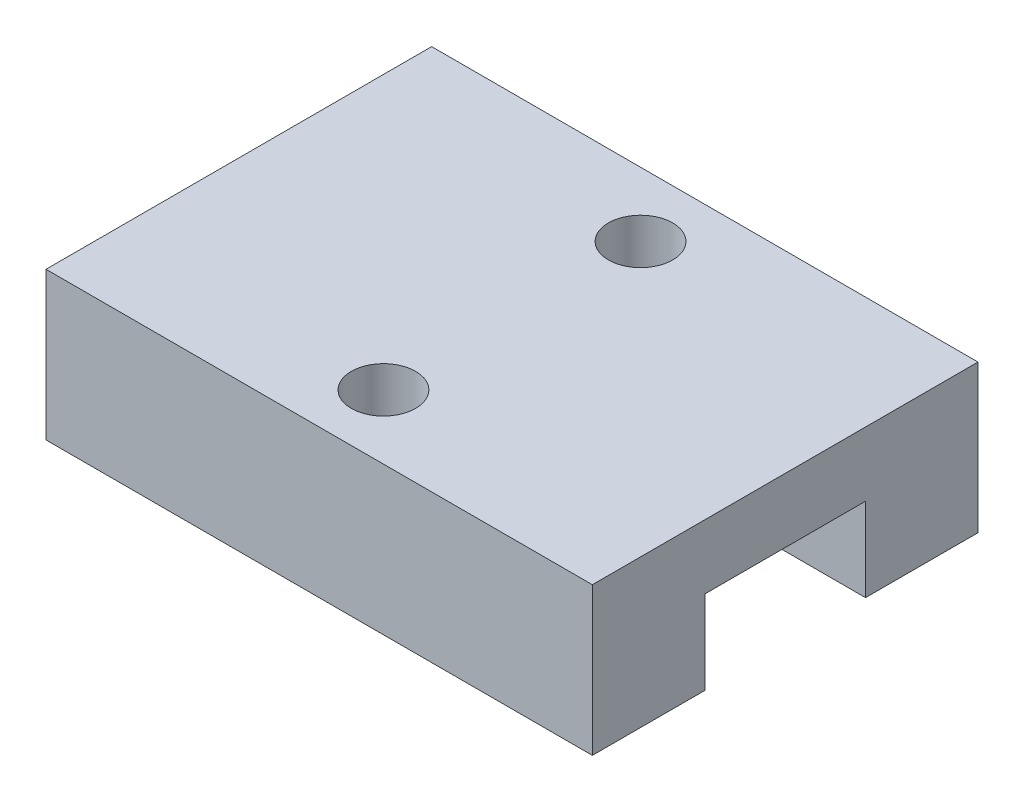
ISO-10303-21;
HEADER;
FILE_DESCRIPTION(('STEP AP214'),'2;1');
FILE_NAME('part.step','',(''),(''),'','','');
FILE_SCHEMA(('AUTOMOTIVE_DESIGN { 1 0 10303 214 1 1 1 1 }'));
ENDSEC;
DATA;
#1=APPLICATION_CONTEXT('core data for automotive mechanical design processes');
#2=APPLICATION_PROTOCOL_DEFINITION('international standard','automotive_design',2000,#1);
#3=PRODUCT_CONTEXT('',#1,'mechanical');
#4=PRODUCT('Part','Part','',(#3));
#5=PRODUCT_RELATED_PRODUCT_CATEGORY('part','',(#4));
#6=PRODUCT_DEFINITION_FORMATION('','',#4);
#7=PRODUCT_DEFINITION_CONTEXT('part definition',#1,'design');
#8=PRODUCT_DEFINITION('design','',#6,#7);
#9=PRODUCT_DEFINITION_SHAPE('','',#8);
#10=(LENGTH_UNIT() NAMED_UNIT(*) SI_UNIT(.MILLI.,.METRE.));
#11=(NAMED_UNIT(*) PLANE_ANGLE_UNIT() SI_UNIT($,.RADIAN.));
#12=(NAMED_UNIT(*) SI_UNIT($,.STERADIAN.) SOLID_ANGLE_UNIT());
#13=UNCERTAINTY_MEASURE_WITH_UNIT(LENGTH_MEASURE(1.E-05),#10,'distance_accuracy_value','');
#14=(GEOMETRIC_REPRESENTATION_CONTEXT(3) GLOBAL_UNCERTAINTY_ASSIGNED_CONTEXT((#13)) GLOBAL_UNIT_ASSIGNED_CONTEXT((#10,
#11,#12)) REPRESENTATION_CONTEXT('',''));
#15=CARTESIAN_POINT('',(0.,0.,0.));
#16=DIRECTION('',(0.,0.,1.));
#17=DIRECTION('',(1.,0.,0.));
#18=AXIS2_PLACEMENT_3D('',#15,#16,#17);
#19=CARTESIAN_POINT('',(0.,0.,0.));
#20=DIRECTION('',(0.,1.,0.));
#21=DIRECTION('',(0.,0.,1.));
#22=AXIS2_PLACEMENT_3D('',#19,#20,#21);
#23=PLANE('',#22);
#24=DIRECTION('',(0.,0.,1.));
#25=VECTOR('',#24,1.);
#26=CARTESIAN_POINT('',(-8.5,0.,-6.));
#27=LINE('',#26,#25);
#28=CARTESIAN_POINT('',(-8.5,0.,2.5));
#29=VERTEX_POINT('',#28);
#30=CARTESIAN_POINT('',(-8.5,0.,6.));
#31=VERTEX_POINT('',#30);
#32=EDGE_CURVE('E144',#29,#31,#27,.T.);
#33=ORIENTED_EDGE('',*,*,#32,.F.);
#34=DIRECTION('',(-1.,0.,0.));
#35=VECTOR('',#34,1.);
#36=CARTESIAN_POINT('',(8.5,0.,2.5));
#37=LINE('',#36,#35);
#38=CARTESIAN_POINT('',(8.5,0.,2.5));
#39=VERTEX_POINT('',#38);
#40=EDGE_CURVE('E134',#39,#29,#37,.T.);
#41=ORIENTED_EDGE('',*,*,#40,.F.);
#42=DIRECTION('',(0.,0.,-1.));
#43=VECTOR('',#42,1.);
#44=CARTESIAN_POINT('',(8.5,0.,-6.));
#45=LINE('',#44,#43);
#46=CARTESIAN_POINT('',(8.5,0.,6.));
#47=VERTEX_POINT('',#46);
#48=EDGE_CURVE('E158',#47,#39,#45,.T.);
#49=ORIENTED_EDGE('',*,*,#48,.F.);
#50=DIRECTION('',(1.,0.,0.));
#51=VECTOR('',#50,1.);
#52=CARTESIAN_POINT('',(-8.5,0.,6.));
#53=LINE('',#52,#51);
#54=EDGE_CURVE('E155',#31,#47,#53,.T.);
#55=ORIENTED_EDGE('',*,*,#54,.F.);
#56=EDGE_LOOP('',(#33,#41,#49,#55));
#57=FACE_BOUND('',#56,.T.);
#58=ADVANCED_FACE('F33',(#57),#23,.F.);
#59=CARTESIAN_POINT('',(-8.5,4.6,-6.));
#60=DIRECTION('',(1.,0.,0.));
#61=DIRECTION('',(0.,0.,-1.));
#62=AXIS2_PLACEMENT_3D('',#59,#60,#61);
#63=PLANE('',#62);
#64=DIRECTION('',(0.,0.,1.));
#65=VECTOR('',#64,1.);
#66=CARTESIAN_POINT('',(-8.5,2.6,-2.5));
#67=LINE('',#66,#65);
#68=CARTESIAN_POINT('',(-8.5,2.6,-2.5));
#69=VERTEX_POINT('',#68);
#70=CARTESIAN_POINT('',(-8.5,2.6,2.5));
#71=VERTEX_POINT('',#70);
#72=EDGE_CURVE('E122',#69,#71,#67,.T.);
#73=ORIENTED_EDGE('',*,*,#72,.T.);
#74=DIRECTION('',(0.,1.,0.));
#75=VECTOR('',#74,1.);
#76=CARTESIAN_POINT('',(-8.5,-17.7200451466694,2.5));
#77=LINE('',#76,#75);
#78=EDGE_CURVE('E140',#29,#71,#77,.T.);
#79=ORIENTED_EDGE('',*,*,#78,.F.);
#80=ORIENTED_EDGE('',*,*,#32,.T.);
#81=DIRECTION('',(0.,-1.,0.));
#82=VECTOR('',#81,1.);
#83=CARTESIAN_POINT('',(-8.5,4.6,6.));
#84=LINE('',#83,#82);
#85=CARTESIAN_POINT('',(-8.5,4.6,6.));
#86=VERTEX_POINT('',#85);
#87=EDGE_CURVE('E11',#86,#31,#84,.T.);
#88=ORIENTED_EDGE('',*,*,#87,.F.);
#89=DIRECTION('',(0.,0.,1.));
#90=VECTOR('',#89,1.);
#91=CARTESIAN_POINT('',(-8.5,4.6,-6.));
#92=LINE('',#91,#90);
#93=CARTESIAN_POINT('',(-8.5,4.6,-6.));
#94=VERTEX_POINT('',#93);
#95=EDGE_CURVE('E145',#94,#86,#92,.T.);
#96=ORIENTED_EDGE('',*,*,#95,.F.);
#97=DIRECTION('',(0.,-1.,0.));
#98=VECTOR('',#97,1.);
#99=CARTESIAN_POINT('',(-8.5,4.6,-6.));
#100=LINE('',#99,#98);
#101=CARTESIAN_POINT('',(-8.5,0.,-6.));
#102=VERTEX_POINT('',#101);
#103=EDGE_CURVE('E151',#94,#102,#100,.T.);
#104=ORIENTED_EDGE('',*,*,#103,.T.);
#105=CARTESIAN_POINT('',(-8.5,0.,-2.5));
#106=VERTEX_POINT('',#105);
#107=EDGE_CURVE('E152',#102,#106,#27,.T.);
#108=ORIENTED_EDGE('',*,*,#107,.T.);
#109=DIRECTION('',(0.,1.,0.));
#110=VECTOR('',#109,1.);
#111=CARTESIAN_POINT('',(-8.5,-17.7200451466694,-2.5));
#112=LINE('',#111,#110);
#113=EDGE_CURVE('E48',#106,#69,#112,.T.);
#114=ORIENTED_EDGE('',*,*,#113,.T.);
#115=EDGE_LOOP('',(#73,#79,#80,#88,#96,#104,#108,#114));
#116=FACE_BOUND('',#115,.T.);
#117=ADVANCED_FACE('F35',(#116),#63,.F.);
#118=CARTESIAN_POINT('',(-8.5,4.6,6.));
#119=DIRECTION('',(0.,0.,-1.));
#120=DIRECTION('',(-1.,0.,0.));
#121=AXIS2_PLACEMENT_3D('',#118,#119,#120);
#122=PLANE('',#121);
#123=ORIENTED_EDGE('',*,*,#54,.T.);
#124=DIRECTION('',(0.,-1.,0.));
#125=VECTOR('',#124,1.);
#126=CARTESIAN_POINT('',(8.5,4.6,6.));
#127=LINE('',#126,#125);
#128=CARTESIAN_POINT('',(8.5,4.6,6.));
#129=VERTEX_POINT('',#128);
#130=EDGE_CURVE('E41',#129,#47,#127,.T.);
#131=ORIENTED_EDGE('',*,*,#130,.F.);
#132=DIRECTION('',(1.,0.,0.));
#133=VECTOR('',#132,1.);
#134=CARTESIAN_POINT('',(-8.5,4.6,6.));
#135=LINE('',#134,#133);
#136=EDGE_CURVE('E85',#86,#129,#135,.T.);
#137=ORIENTED_EDGE('',*,*,#136,.F.);
#138=ORIENTED_EDGE('',*,*,#87,.T.);
#139=EDGE_LOOP('',(#123,#131,#137,#138));
#140=FACE_BOUND('',#139,.T.);
#141=ADVANCED_FACE('F198',(#140),#122,.F.);
#142=CARTESIAN_POINT('',(8.5,4.6,-6.));
#143=DIRECTION('',(-1.,0.,0.));
#144=DIRECTION('',(0.,0.,1.));
#145=AXIS2_PLACEMENT_3D('',#142,#143,#144);
#146=PLANE('',#145);
#147=ORIENTED_EDGE('',*,*,#48,.T.);
#148=DIRECTION('',(0.,1.,0.));
#149=VECTOR('',#148,1.);
#150=CARTESIAN_POINT('',(8.5,-17.7200451466694,2.5));
#151=LINE('',#150,#149);
#152=CARTESIAN_POINT('',(8.5,2.6,2.5));
#153=VERTEX_POINT('',#152);
#154=EDGE_CURVE('E127',#39,#153,#151,.T.);
#155=ORIENTED_EDGE('',*,*,#154,.T.);
#156=DIRECTION('',(0.,0.,-1.));
#157=VECTOR('',#156,1.);
#158=CARTESIAN_POINT('',(8.5,2.6,-2.5));
#159=LINE('',#158,#157);
#160=CARTESIAN_POINT('',(8.5,2.6,-2.5));
#161=VERTEX_POINT('',#160);
#162=EDGE_CURVE('E119',#153,#161,#159,.T.);
#163=ORIENTED_EDGE('',*,*,#162,.T.);
#164=DIRECTION('',(0.,1.,0.));
#165=VECTOR('',#164,1.);
#166=CARTESIAN_POINT('',(8.5,-17.7200451466694,-2.5));
#167=LINE('',#166,#165);
#168=CARTESIAN_POINT('',(8.5,0.,-2.5));
#169=VERTEX_POINT('',#168);
#170=EDGE_CURVE('E106',#169,#161,#167,.T.);
#171=ORIENTED_EDGE('',*,*,#170,.F.);
#172=CARTESIAN_POINT('',(8.5,0.,-6.));
#173=VERTEX_POINT('',#172);
#174=EDGE_CURVE('E157',#169,#173,#45,.T.);
#175=ORIENTED_EDGE('',*,*,#174,.T.);
#176=DIRECTION('',(0.,-1.,0.));
#177=VECTOR('',#176,1.);
#178=CARTESIAN_POINT('',(8.5,4.6,-6.));
#179=LINE('',#178,#177);
#180=CARTESIAN_POINT('',(8.5,4.6,-6.));
#181=VERTEX_POINT('',#180);
#182=EDGE_CURVE('E162',#181,#173,#179,.T.);
#183=ORIENTED_EDGE('',*,*,#182,.F.);
#184=DIRECTION('',(0.,0.,-1.));
#185=VECTOR('',#184,1.);
#186=CARTESIAN_POINT('',(8.5,4.6,-6.));
#187=LINE('',#186,#185);
#188=EDGE_CURVE('E148',#129,#181,#187,.T.);
#189=ORIENTED_EDGE('',*,*,#188,.F.);
#190=ORIENTED_EDGE('',*,*,#130,.T.);
#191=EDGE_LOOP('',(#147,#155,#163,#171,#175,#183,#189,#190));
#192=FACE_BOUND('',#191,.T.);
#193=ADVANCED_FACE('F126',(#192),#146,.F.);
#194=CARTESIAN_POINT('',(-8.5,4.6,-6.));
#195=DIRECTION('',(0.,0.,1.));
#196=DIRECTION('',(1.,0.,0.));
#197=AXIS2_PLACEMENT_3D('',#194,#195,#196);
#198=PLANE('',#197);
#199=DIRECTION('',(-1.,0.,0.));
#200=VECTOR('',#199,1.);
#201=CARTESIAN_POINT('',(-8.5,0.,-6.));
#202=LINE('',#201,#200);
#203=EDGE_CURVE('E78',#173,#102,#202,.T.);
#204=ORIENTED_EDGE('',*,*,#203,.T.);
#205=ORIENTED_EDGE('',*,*,#103,.F.);
#206=DIRECTION('',(-1.,0.,0.));
#207=VECTOR('',#206,1.);
#208=CARTESIAN_POINT('',(-8.5,4.6,-6.));
#209=LINE('',#208,#207);
#210=EDGE_CURVE('E57',#181,#94,#209,.T.);
#211=ORIENTED_EDGE('',*,*,#210,.F.);
#212=ORIENTED_EDGE('',*,*,#182,.T.);
#213=EDGE_LOOP('',(#204,#205,#211,#212));
#214=FACE_BOUND('',#213,.T.);
#215=ADVANCED_FACE('F180',(#214),#198,.F.);
#216=CARTESIAN_POINT('',(0.,4.6,0.));
#217=DIRECTION('',(0.,1.,0.));
#218=DIRECTION('',(0.,0.,1.));
#219=AXIS2_PLACEMENT_3D('',#216,#217,#218);
#220=PLANE('',#219);
#221=CARTESIAN_POINT('',(0.,4.6,4.));
#222=DIRECTION('',(0.,1.,0.));
#223=DIRECTION('',(0.,0.,1.));
#224=AXIS2_PLACEMENT_3D('',#221,#222,#223);
#225=CIRCLE('',#224,1.);
#226=CARTESIAN_POINT('',(0.,4.6,5.));
#227=VERTEX_POINT('',#226);
#228=EDGE_CURVE('E303',#227,#227,#225,.T.);
#229=ORIENTED_EDGE('',*,*,#228,.F.);
#230=EDGE_LOOP('',(#229));
#231=FACE_BOUND('',#230,.T.);
#232=CARTESIAN_POINT('',(0.,4.6,-4.));
#233=DIRECTION('',(0.,1.,0.));
#234=DIRECTION('',(0.,0.,1.));
#235=AXIS2_PLACEMENT_3D('',#232,#233,#234);
#236=CIRCLE('',#235,1.);
#237=CARTESIAN_POINT('',(0.,4.6,-3.));
#238=VERTEX_POINT('',#237);
#239=EDGE_CURVE('E131',#238,#238,#236,.T.);
#240=ORIENTED_EDGE('',*,*,#239,.F.);
#241=EDGE_LOOP('',(#240));
#242=FACE_BOUND('',#241,.T.);
#243=ORIENTED_EDGE('',*,*,#95,.T.);
#244=ORIENTED_EDGE('',*,*,#136,.T.);
#245=ORIENTED_EDGE('',*,*,#188,.T.);
#246=ORIENTED_EDGE('',*,*,#210,.T.);
#247=EDGE_LOOP('',(#243,#244,#245,#246));
#248=FACE_BOUND('',#247,.T.);
#249=ADVANCED_FACE('F181',(#231,#242,#248),#220,.T.);
#250=ORIENTED_EDGE('',*,*,#174,.F.);
#251=DIRECTION('',(1.,0.,0.));
#252=VECTOR('',#251,1.);
#253=CARTESIAN_POINT('',(8.5,0.,-2.5));
#254=LINE('',#253,#252);
#255=EDGE_CURVE('E110',#106,#169,#254,.T.);
#256=ORIENTED_EDGE('',*,*,#255,.F.);
#257=ORIENTED_EDGE('',*,*,#107,.F.);
#258=ORIENTED_EDGE('',*,*,#203,.F.);
#259=EDGE_LOOP('',(#250,#256,#257,#258));
#260=FACE_BOUND('',#259,.T.);
#261=ADVANCED_FACE('F179',(#260),#23,.F.);
#262=CARTESIAN_POINT('',(8.5,-17.7200451466694,2.5));
#263=DIRECTION('',(0.,0.,1.));
#264=DIRECTION('',(1.,0.,0.));
#265=AXIS2_PLACEMENT_3D('',#262,#263,#264);
#266=PLANE('',#265);
#267=ORIENTED_EDGE('',*,*,#40,.T.);
#268=ORIENTED_EDGE('',*,*,#78,.T.);
#269=DIRECTION('',(1.,0.,0.));
#270=VECTOR('',#269,1.);
#271=CARTESIAN_POINT('',(8.5,2.6,2.5));
#272=LINE('',#271,#270);
#273=EDGE_CURVE('E114',#71,#153,#272,.T.);
#274=ORIENTED_EDGE('',*,*,#273,.T.);
#275=ORIENTED_EDGE('',*,*,#154,.F.);
#276=EDGE_LOOP('',(#267,#268,#274,#275));
#277=FACE_BOUND('',#276,.T.);
#278=ADVANCED_FACE('F173',(#277),#266,.F.);
#279=CARTESIAN_POINT('',(8.5,-17.7200451466694,-2.5));
#280=DIRECTION('',(0.,0.,-1.));
#281=DIRECTION('',(-1.,0.,0.));
#282=AXIS2_PLACEMENT_3D('',#279,#280,#281);
#283=PLANE('',#282);
#284=ORIENTED_EDGE('',*,*,#255,.T.);
#285=ORIENTED_EDGE('',*,*,#170,.T.);
#286=DIRECTION('',(-1.,0.,0.));
#287=VECTOR('',#286,1.);
#288=CARTESIAN_POINT('',(8.5,2.6,-2.5));
#289=LINE('',#288,#287);
#290=EDGE_CURVE('E109',#161,#69,#289,.T.);
#291=ORIENTED_EDGE('',*,*,#290,.T.);
#292=ORIENTED_EDGE('',*,*,#113,.F.);
#293=EDGE_LOOP('',(#284,#285,#291,#292));
#294=FACE_BOUND('',#293,.T.);
#295=ADVANCED_FACE('F108',(#294),#283,.F.);
#296=CARTESIAN_POINT('',(0.,2.6,0.));
#297=DIRECTION('',(0.,-1.,0.));
#298=DIRECTION('',(0.,0.,-1.));
#299=AXIS2_PLACEMENT_3D('',#296,#297,#298);
#300=PLANE('',#299);
#301=ORIENTED_EDGE('',*,*,#162,.F.);
#302=ORIENTED_EDGE('',*,*,#273,.F.);
#303=ORIENTED_EDGE('',*,*,#72,.F.);
#304=ORIENTED_EDGE('',*,*,#290,.F.);
#305=EDGE_LOOP('',(#301,#302,#303,#304));
#306=FACE_BOUND('',#305,.T.);
#307=ADVANCED_FACE('F117',(#306),#300,.T.);
#308=CARTESIAN_POINT('',(0.,2.6,-4.));
#309=DIRECTION('',(0.,1.,0.));
#310=DIRECTION('',(0.,0.,1.));
#311=AXIS2_PLACEMENT_3D('',#308,#309,#310);
#312=CYLINDRICAL_SURFACE('',#311,1.);
#313=CARTESIAN_POINT('',(0.,2.6,-4.));
#314=DIRECTION('',(0.,1.,0.));
#315=DIRECTION('',(0.,0.,1.));
#316=AXIS2_PLACEMENT_3D('',#313,#314,#315);
#317=CIRCLE('',#316,1.);
#318=CARTESIAN_POINT('',(0.,2.6,-3.));
#319=VERTEX_POINT('',#318);
#320=EDGE_CURVE('E128',#319,#319,#317,.T.);
#321=ORIENTED_EDGE('',*,*,#320,.F.);
#322=EDGE_LOOP('',(#321));
#323=FACE_BOUND('',#322,.T.);
#324=ORIENTED_EDGE('',*,*,#239,.T.);
#325=EDGE_LOOP('',(#324));
#326=FACE_BOUND('',#325,.T.);
#327=ADVANCED_FACE('F254',(#323,#326),#312,.F.);
#328=CARTESIAN_POINT('',(0.,2.6,-4.));
#329=DIRECTION('',(0.,1.,0.));
#330=DIRECTION('',(0.,0.,1.));
#331=AXIS2_PLACEMENT_3D('',#328,#329,#330);
#332=PLANE('',#331);
#333=ORIENTED_EDGE('',*,*,#320,.T.);
#334=EDGE_LOOP('',(#333));
#335=FACE_BOUND('',#334,.T.);
#336=ADVANCED_FACE('F262',(#335),#332,.T.);
#337=CARTESIAN_POINT('',(0.,2.6,4.));
#338=DIRECTION('',(0.,1.,0.));
#339=DIRECTION('',(0.,0.,1.));
#340=AXIS2_PLACEMENT_3D('',#337,#338,#339);
#341=CYLINDRICAL_SURFACE('',#340,1.);
#342=CARTESIAN_POINT('',(0.,2.6,4.));
#343=DIRECTION('',(0.,1.,0.));
#344=DIRECTION('',(0.,0.,1.));
#345=AXIS2_PLACEMENT_3D('',#342,#343,#344);
#346=CIRCLE('',#345,1.);
#347=CARTESIAN_POINT('',(0.,2.6,5.));
#348=VERTEX_POINT('',#347);
#349=EDGE_CURVE('E302',#348,#348,#346,.T.);
#350=ORIENTED_EDGE('',*,*,#349,.F.);
#351=EDGE_LOOP('',(#350));
#352=FACE_BOUND('',#351,.T.);
#353=ORIENTED_EDGE('',*,*,#228,.T.);
#354=EDGE_LOOP('',(#353));
#355=FACE_BOUND('',#354,.T.);
#356=ADVANCED_FACE('F271',(#352,#355),#341,.F.);
#357=CARTESIAN_POINT('',(0.,2.6,4.));
#358=DIRECTION('',(0.,1.,0.));
#359=DIRECTION('',(0.,0.,1.));
#360=AXIS2_PLACEMENT_3D('',#357,#358,#359);
#361=PLANE('',#360);
#362=ORIENTED_EDGE('',*,*,#349,.T.);
#363=EDGE_LOOP('',(#362));
#364=FACE_BOUND('',#363,.T.);
#365=ADVANCED_FACE('F280',(#364),#361,.T.);
#366=CLOSED_SHELL('',(#58,#117,#141,#193,#215,#249,#261,#278,#295,#307,#327,#336,#356,#365));
#367=MANIFOLD_SOLID_BREP('B2',#366);
#368=ADVANCED_BREP_SHAPE_REPRESENTATION('',(#18,#367),#14);
#369=SHAPE_DEFINITION_REPRESENTATION(#9,#368);
ENDSEC;
END-ISO-10303-21;
